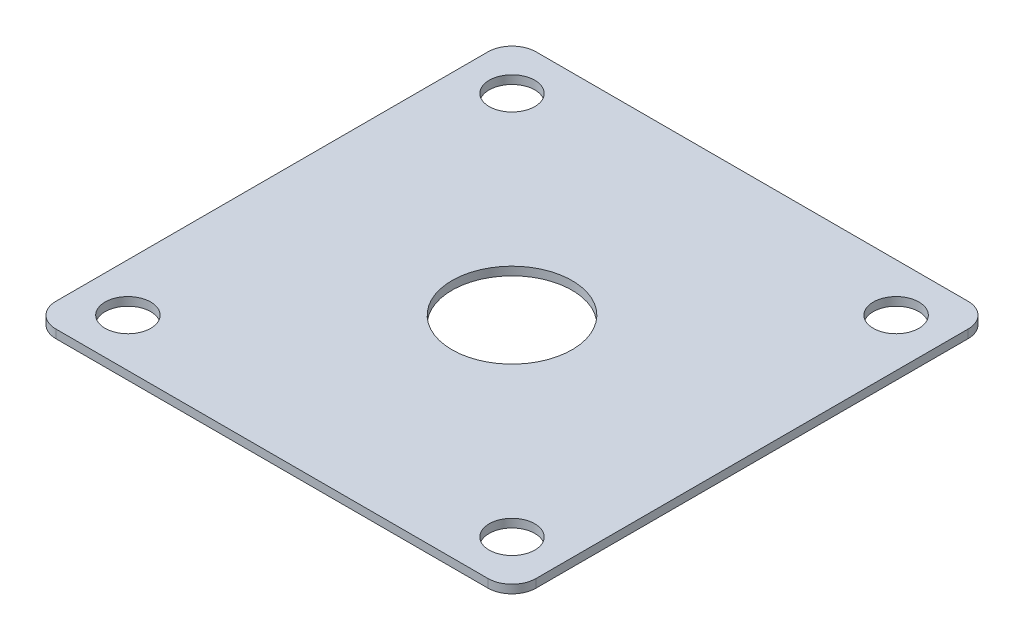
ISO-10303-21;
HEADER;
FILE_DESCRIPTION(('STEP AP214'),'2;1');
FILE_NAME('part.step','',(''),(''),'','','');
FILE_SCHEMA(('AUTOMOTIVE_DESIGN { 1 0 10303 214 1 1 1 1 }'));
ENDSEC;
DATA;
#1=APPLICATION_CONTEXT('core data for automotive mechanical design processes');
#2=APPLICATION_PROTOCOL_DEFINITION('international standard','automotive_design',2000,#1);
#3=PRODUCT_CONTEXT('',#1,'mechanical');
#4=PRODUCT('Part','Part','',(#3));
#5=PRODUCT_RELATED_PRODUCT_CATEGORY('part','',(#4));
#6=PRODUCT_DEFINITION_FORMATION('','',#4);
#7=PRODUCT_DEFINITION_CONTEXT('part definition',#1,'design');
#8=PRODUCT_DEFINITION('design','',#6,#7);
#9=PRODUCT_DEFINITION_SHAPE('','',#8);
#10=(LENGTH_UNIT() NAMED_UNIT(*) SI_UNIT(.MILLI.,.METRE.));
#11=(NAMED_UNIT(*) PLANE_ANGLE_UNIT() SI_UNIT($,.RADIAN.));
#12=(NAMED_UNIT(*) SI_UNIT($,.STERADIAN.) SOLID_ANGLE_UNIT());
#13=UNCERTAINTY_MEASURE_WITH_UNIT(LENGTH_MEASURE(1.E-05),#10,'distance_accuracy_value','');
#14=(GEOMETRIC_REPRESENTATION_CONTEXT(3) GLOBAL_UNCERTAINTY_ASSIGNED_CONTEXT((#13)) GLOBAL_UNIT_ASSIGNED_CONTEXT((#10,
#11,#12)) REPRESENTATION_CONTEXT('',''));
#15=CARTESIAN_POINT('',(0.,0.,0.));
#16=DIRECTION('',(0.,0.,1.));
#17=DIRECTION('',(1.,0.,0.));
#18=AXIS2_PLACEMENT_3D('',#15,#16,#17);
#19=CARTESIAN_POINT('',(0.,0.889,0.));
#20=DIRECTION('',(0.,1.,0.));
#21=DIRECTION('',(0.,0.,1.));
#22=AXIS2_PLACEMENT_3D('',#19,#20,#21);
#23=PLANE('',#22);
#24=CARTESIAN_POINT('',(20.32,0.889,20.32));
#25=DIRECTION('',(0.,1.,0.));
#26=DIRECTION('',(0.,0.,1.));
#27=AXIS2_PLACEMENT_3D('',#24,#25,#26);
#28=CIRCLE('',#27,2.413);
#29=CARTESIAN_POINT('',(20.32,0.889,22.733));
#30=VERTEX_POINT('',#29);
#31=EDGE_CURVE('E215',#30,#30,#28,.T.);
#32=ORIENTED_EDGE('',*,*,#31,.F.);
#33=EDGE_LOOP('',(#32));
#34=FACE_BOUND('',#33,.T.);
#35=CARTESIAN_POINT('',(-20.32,0.889,-20.32));
#36=DIRECTION('',(0.,1.,0.));
#37=DIRECTION('',(0.,0.,1.));
#38=AXIS2_PLACEMENT_3D('',#35,#36,#37);
#39=CIRCLE('',#38,2.413);
#40=CARTESIAN_POINT('',(-20.32,0.889,-17.907));
#41=VERTEX_POINT('',#40);
#42=EDGE_CURVE('E199',#41,#41,#39,.T.);
#43=ORIENTED_EDGE('',*,*,#42,.F.);
#44=EDGE_LOOP('',(#43));
#45=FACE_BOUND('',#44,.T.);
#46=DIRECTION('',(0.,0.,1.));
#47=VECTOR('',#46,1.);
#48=CARTESIAN_POINT('',(-25.4,0.889,-25.4));
#49=LINE('',#48,#47);
#50=CARTESIAN_POINT('',(-25.4,0.889,-22.86));
#51=VERTEX_POINT('',#50);
#52=CARTESIAN_POINT('',(-25.4,0.889,22.86));
#53=VERTEX_POINT('',#52);
#54=EDGE_CURVE('E150',#51,#53,#49,.T.);
#55=ORIENTED_EDGE('',*,*,#54,.T.);
#56=CARTESIAN_POINT('',(-22.86,0.889,22.86));
#57=DIRECTION('',(0.,1.,0.));
#58=DIRECTION('',(0.,0.,1.));
#59=AXIS2_PLACEMENT_3D('',#56,#57,#58);
#60=CIRCLE('',#59,2.54);
#61=CARTESIAN_POINT('',(-22.86,0.889,25.4));
#62=VERTEX_POINT('',#61);
#63=EDGE_CURVE('E174',#53,#62,#60,.T.);
#64=ORIENTED_EDGE('',*,*,#63,.T.);
#65=DIRECTION('',(1.,0.,0.));
#66=VECTOR('',#65,1.);
#67=CARTESIAN_POINT('',(-25.4,0.889,25.4));
#68=LINE('',#67,#66);
#69=CARTESIAN_POINT('',(22.86,0.889,25.4));
#70=VERTEX_POINT('',#69);
#71=EDGE_CURVE('E127',#62,#70,#68,.T.);
#72=ORIENTED_EDGE('',*,*,#71,.T.);
#73=CARTESIAN_POINT('',(22.86,0.889,22.86));
#74=DIRECTION('',(0.,1.,0.));
#75=DIRECTION('',(0.,0.,1.));
#76=AXIS2_PLACEMENT_3D('',#73,#74,#75);
#77=CIRCLE('',#76,2.54);
#78=CARTESIAN_POINT('',(25.4,0.889,22.86));
#79=VERTEX_POINT('',#78);
#80=EDGE_CURVE('E171',#70,#79,#77,.T.);
#81=ORIENTED_EDGE('',*,*,#80,.T.);
#82=DIRECTION('',(0.,0.,-1.));
#83=VECTOR('',#82,1.);
#84=CARTESIAN_POINT('',(25.4,0.889,-25.4));
#85=LINE('',#84,#83);
#86=CARTESIAN_POINT('',(25.4,0.889,-22.86));
#87=VERTEX_POINT('',#86);
#88=EDGE_CURVE('E186',#79,#87,#85,.T.);
#89=ORIENTED_EDGE('',*,*,#88,.T.);
#90=CARTESIAN_POINT('',(22.86,0.889,-22.86));
#91=DIRECTION('',(0.,1.,0.));
#92=DIRECTION('',(0.,0.,1.));
#93=AXIS2_PLACEMENT_3D('',#90,#91,#92);
#94=CIRCLE('',#93,2.54);
#95=CARTESIAN_POINT('',(22.86,0.889,-25.4));
#96=VERTEX_POINT('',#95);
#97=EDGE_CURVE('E61',#87,#96,#94,.T.);
#98=ORIENTED_EDGE('',*,*,#97,.T.);
#99=DIRECTION('',(-1.,0.,0.));
#100=VECTOR('',#99,1.);
#101=CARTESIAN_POINT('',(-25.4,0.889,-25.4));
#102=LINE('',#101,#100);
#103=CARTESIAN_POINT('',(-22.86,0.889,-25.4));
#104=VERTEX_POINT('',#103);
#105=EDGE_CURVE('E152',#96,#104,#102,.T.);
#106=ORIENTED_EDGE('',*,*,#105,.T.);
#107=CARTESIAN_POINT('',(-22.86,0.889,-22.86));
#108=DIRECTION('',(0.,1.,0.));
#109=DIRECTION('',(0.,0.,1.));
#110=AXIS2_PLACEMENT_3D('',#107,#108,#109);
#111=CIRCLE('',#110,2.54);
#112=EDGE_CURVE('E166',#104,#51,#111,.T.);
#113=ORIENTED_EDGE('',*,*,#112,.T.);
#114=EDGE_LOOP('',(#55,#64,#72,#81,#89,#98,#106,#113));
#115=FACE_BOUND('',#114,.T.);
#116=CARTESIAN_POINT('',(0.,0.889,0.));
#117=DIRECTION('',(0.,1.,0.));
#118=DIRECTION('',(0.,0.,1.));
#119=AXIS2_PLACEMENT_3D('',#116,#117,#118);
#120=CIRCLE('',#119,6.35);
#121=CARTESIAN_POINT('',(0.,0.889,6.35));
#122=VERTEX_POINT('',#121);
#123=EDGE_CURVE('E144',#122,#122,#120,.T.);
#124=ORIENTED_EDGE('',*,*,#123,.F.);
#125=EDGE_LOOP('',(#124));
#126=FACE_BOUND('',#125,.T.);
#127=CARTESIAN_POINT('',(-20.32,0.889,20.32));
#128=DIRECTION('',(0.,1.,0.));
#129=DIRECTION('',(0.,0.,-1.));
#130=AXIS2_PLACEMENT_3D('',#127,#128,#129);
#131=CIRCLE('',#130,2.413);
#132=CARTESIAN_POINT('',(-20.32,0.889,17.907));
#133=VERTEX_POINT('',#132);
#134=EDGE_CURVE('E207',#133,#133,#131,.T.);
#135=ORIENTED_EDGE('',*,*,#134,.F.);
#136=EDGE_LOOP('',(#135));
#137=FACE_BOUND('',#136,.T.);
#138=CARTESIAN_POINT('',(20.32,0.889,-20.32));
#139=DIRECTION('',(0.,1.,0.));
#140=DIRECTION('',(0.,0.,-1.));
#141=AXIS2_PLACEMENT_3D('',#138,#139,#140);
#142=CIRCLE('',#141,2.413);
#143=CARTESIAN_POINT('',(20.32,0.889,-22.733));
#144=VERTEX_POINT('',#143);
#145=EDGE_CURVE('E223',#144,#144,#142,.T.);
#146=ORIENTED_EDGE('',*,*,#145,.F.);
#147=EDGE_LOOP('',(#146));
#148=FACE_BOUND('',#147,.T.);
#149=ADVANCED_FACE('F39',(#34,#45,#115,#126,#137,#148),#23,.T.);
#150=CARTESIAN_POINT('',(0.,0.,0.));
#151=DIRECTION('',(0.,1.,0.));
#152=DIRECTION('',(0.,0.,1.));
#153=AXIS2_PLACEMENT_3D('',#150,#151,#152);
#154=PLANE('',#153);
#155=DIRECTION('',(1.,0.,0.));
#156=VECTOR('',#155,1.);
#157=CARTESIAN_POINT('',(-25.4,0.,25.4));
#158=LINE('',#157,#156);
#159=CARTESIAN_POINT('',(-22.86,0.,25.4));
#160=VERTEX_POINT('',#159);
#161=CARTESIAN_POINT('',(22.86,0.,25.4));
#162=VERTEX_POINT('',#161);
#163=EDGE_CURVE('E124',#160,#162,#158,.T.);
#164=ORIENTED_EDGE('',*,*,#163,.F.);
#165=CARTESIAN_POINT('',(-22.86,0.,22.86));
#166=DIRECTION('',(0.,1.,0.));
#167=DIRECTION('',(0.,0.,1.));
#168=AXIS2_PLACEMENT_3D('',#165,#166,#167);
#169=CIRCLE('',#168,2.54);
#170=CARTESIAN_POINT('',(-25.4,0.,22.86));
#171=VERTEX_POINT('',#170);
#172=EDGE_CURVE('E106',#160,#171,#169,.F.);
#173=ORIENTED_EDGE('',*,*,#172,.T.);
#174=DIRECTION('',(0.,0.,1.));
#175=VECTOR('',#174,1.);
#176=CARTESIAN_POINT('',(-25.4,0.,-25.4));
#177=LINE('',#176,#175);
#178=CARTESIAN_POINT('',(-25.4,0.,-22.86));
#179=VERTEX_POINT('',#178);
#180=EDGE_CURVE('E137',#179,#171,#177,.T.);
#181=ORIENTED_EDGE('',*,*,#180,.F.);
#182=CARTESIAN_POINT('',(-22.86,0.,-22.86));
#183=DIRECTION('',(0.,1.,0.));
#184=DIRECTION('',(0.,0.,1.));
#185=AXIS2_PLACEMENT_3D('',#182,#183,#184);
#186=CIRCLE('',#185,2.54);
#187=CARTESIAN_POINT('',(-22.86,0.,-25.4));
#188=VERTEX_POINT('',#187);
#189=EDGE_CURVE('E129',#179,#188,#186,.F.);
#190=ORIENTED_EDGE('',*,*,#189,.T.);
#191=DIRECTION('',(-1.,0.,0.));
#192=VECTOR('',#191,1.);
#193=CARTESIAN_POINT('',(-25.4,0.,-25.4));
#194=LINE('',#193,#192);
#195=CARTESIAN_POINT('',(22.86,0.,-25.4));
#196=VERTEX_POINT('',#195);
#197=EDGE_CURVE('E142',#196,#188,#194,.T.);
#198=ORIENTED_EDGE('',*,*,#197,.F.);
#199=CARTESIAN_POINT('',(22.86,0.,-22.86));
#200=DIRECTION('',(0.,1.,0.));
#201=DIRECTION('',(0.,0.,1.));
#202=AXIS2_PLACEMENT_3D('',#199,#200,#201);
#203=CIRCLE('',#202,2.54);
#204=CARTESIAN_POINT('',(25.4,0.,-22.86));
#205=VERTEX_POINT('',#204);
#206=EDGE_CURVE('E156',#196,#205,#203,.F.);
#207=ORIENTED_EDGE('',*,*,#206,.T.);
#208=DIRECTION('',(0.,0.,-1.));
#209=VECTOR('',#208,1.);
#210=CARTESIAN_POINT('',(25.4,0.,-25.4));
#211=LINE('',#210,#209);
#212=CARTESIAN_POINT('',(25.4,0.,22.86));
#213=VERTEX_POINT('',#212);
#214=EDGE_CURVE('E136',#213,#205,#211,.T.);
#215=ORIENTED_EDGE('',*,*,#214,.F.);
#216=CARTESIAN_POINT('',(22.86,0.,22.86));
#217=DIRECTION('',(0.,1.,0.));
#218=DIRECTION('',(0.,0.,1.));
#219=AXIS2_PLACEMENT_3D('',#216,#217,#218);
#220=CIRCLE('',#219,2.54);
#221=EDGE_CURVE('E118',#213,#162,#220,.F.);
#222=ORIENTED_EDGE('',*,*,#221,.T.);
#223=EDGE_LOOP('',(#164,#173,#181,#190,#198,#207,#215,#222));
#224=FACE_BOUND('',#223,.T.);
#225=CARTESIAN_POINT('',(0.,0.,0.));
#226=DIRECTION('',(0.,1.,0.));
#227=DIRECTION('',(0.,0.,1.));
#228=AXIS2_PLACEMENT_3D('',#225,#226,#227);
#229=CIRCLE('',#228,6.35);
#230=CARTESIAN_POINT('',(0.,0.,6.35));
#231=VERTEX_POINT('',#230);
#232=EDGE_CURVE('E195',#231,#231,#229,.T.);
#233=ORIENTED_EDGE('',*,*,#232,.T.);
#234=EDGE_LOOP('',(#233));
#235=FACE_BOUND('',#234,.T.);
#236=CARTESIAN_POINT('',(-20.32,0.,-20.32));
#237=DIRECTION('',(0.,1.,0.));
#238=DIRECTION('',(0.,0.,1.));
#239=AXIS2_PLACEMENT_3D('',#236,#237,#238);
#240=CIRCLE('',#239,2.413);
#241=CARTESIAN_POINT('',(-20.32,0.,-17.907));
#242=VERTEX_POINT('',#241);
#243=EDGE_CURVE('E203',#242,#242,#240,.T.);
#244=ORIENTED_EDGE('',*,*,#243,.T.);
#245=EDGE_LOOP('',(#244));
#246=FACE_BOUND('',#245,.T.);
#247=CARTESIAN_POINT('',(-20.32,0.,20.32));
#248=DIRECTION('',(0.,1.,0.));
#249=DIRECTION('',(0.,0.,-1.));
#250=AXIS2_PLACEMENT_3D('',#247,#248,#249);
#251=CIRCLE('',#250,2.413);
#252=CARTESIAN_POINT('',(-20.32,0.,17.907));
#253=VERTEX_POINT('',#252);
#254=EDGE_CURVE('E211',#253,#253,#251,.T.);
#255=ORIENTED_EDGE('',*,*,#254,.T.);
#256=EDGE_LOOP('',(#255));
#257=FACE_BOUND('',#256,.T.);
#258=CARTESIAN_POINT('',(20.32,0.,20.32));
#259=DIRECTION('',(0.,1.,0.));
#260=DIRECTION('',(0.,0.,1.));
#261=AXIS2_PLACEMENT_3D('',#258,#259,#260);
#262=CIRCLE('',#261,2.413);
#263=CARTESIAN_POINT('',(20.32,0.,22.733));
#264=VERTEX_POINT('',#263);
#265=EDGE_CURVE('E219',#264,#264,#262,.T.);
#266=ORIENTED_EDGE('',*,*,#265,.T.);
#267=EDGE_LOOP('',(#266));
#268=FACE_BOUND('',#267,.T.);
#269=CARTESIAN_POINT('',(20.32,0.,-20.32));
#270=DIRECTION('',(0.,1.,0.));
#271=DIRECTION('',(0.,0.,-1.));
#272=AXIS2_PLACEMENT_3D('',#269,#270,#271);
#273=CIRCLE('',#272,2.413);
#274=CARTESIAN_POINT('',(20.32,0.,-22.733));
#275=VERTEX_POINT('',#274);
#276=EDGE_CURVE('E227',#275,#275,#273,.T.);
#277=ORIENTED_EDGE('',*,*,#276,.T.);
#278=EDGE_LOOP('',(#277));
#279=FACE_BOUND('',#278,.T.);
#280=ADVANCED_FACE('F132',(#224,#235,#246,#257,#268,#279),#154,.F.);
#281=CARTESIAN_POINT('',(-25.4,0.889,-25.4));
#282=DIRECTION('',(1.,0.,0.));
#283=DIRECTION('',(0.,0.,-1.));
#284=AXIS2_PLACEMENT_3D('',#281,#282,#283);
#285=PLANE('',#284);
#286=ORIENTED_EDGE('',*,*,#180,.T.);
#287=DIRECTION('',(0.,-1.,0.));
#288=VECTOR('',#287,1.);
#289=CARTESIAN_POINT('',(-25.4,0.889,22.86));
#290=LINE('',#289,#288);
#291=EDGE_CURVE('E111',#171,#53,#290,.F.);
#292=ORIENTED_EDGE('',*,*,#291,.T.);
#293=ORIENTED_EDGE('',*,*,#54,.F.);
#294=DIRECTION('',(0.,-1.,0.));
#295=VECTOR('',#294,1.);
#296=CARTESIAN_POINT('',(-25.4,0.889,-22.86));
#297=LINE('',#296,#295);
#298=EDGE_CURVE('E117',#51,#179,#297,.T.);
#299=ORIENTED_EDGE('',*,*,#298,.T.);
#300=EDGE_LOOP('',(#286,#292,#293,#299));
#301=FACE_BOUND('',#300,.T.);
#302=ADVANCED_FACE('F244',(#301),#285,.F.);
#303=CARTESIAN_POINT('',(-25.4,0.889,25.4));
#304=DIRECTION('',(0.,0.,-1.));
#305=DIRECTION('',(-1.,0.,0.));
#306=AXIS2_PLACEMENT_3D('',#303,#304,#305);
#307=PLANE('',#306);
#308=ORIENTED_EDGE('',*,*,#71,.F.);
#309=DIRECTION('',(0.,-1.,0.));
#310=VECTOR('',#309,1.);
#311=CARTESIAN_POINT('',(-22.86,0.889,25.4));
#312=LINE('',#311,#310);
#313=EDGE_CURVE('E110',#62,#160,#312,.T.);
#314=ORIENTED_EDGE('',*,*,#313,.T.);
#315=ORIENTED_EDGE('',*,*,#163,.T.);
#316=DIRECTION('',(0.,-1.,0.));
#317=VECTOR('',#316,1.);
#318=CARTESIAN_POINT('',(22.86,0.889,25.4));
#319=LINE('',#318,#317);
#320=EDGE_CURVE('E130',#162,#70,#319,.F.);
#321=ORIENTED_EDGE('',*,*,#320,.T.);
#322=EDGE_LOOP('',(#308,#314,#315,#321));
#323=FACE_BOUND('',#322,.T.);
#324=ADVANCED_FACE('F123',(#323),#307,.F.);
#325=CARTESIAN_POINT('',(25.4,0.889,-25.4));
#326=DIRECTION('',(-1.,0.,0.));
#327=DIRECTION('',(0.,0.,1.));
#328=AXIS2_PLACEMENT_3D('',#325,#326,#327);
#329=PLANE('',#328);
#330=ORIENTED_EDGE('',*,*,#88,.F.);
#331=DIRECTION('',(0.,-1.,0.));
#332=VECTOR('',#331,1.);
#333=CARTESIAN_POINT('',(25.4,0.889,22.86));
#334=LINE('',#333,#332);
#335=EDGE_CURVE('E180',#79,#213,#334,.T.);
#336=ORIENTED_EDGE('',*,*,#335,.T.);
#337=ORIENTED_EDGE('',*,*,#214,.T.);
#338=DIRECTION('',(0.,-1.,0.));
#339=VECTOR('',#338,1.);
#340=CARTESIAN_POINT('',(25.4,0.889,-22.86));
#341=LINE('',#340,#339);
#342=EDGE_CURVE('E177',#205,#87,#341,.F.);
#343=ORIENTED_EDGE('',*,*,#342,.T.);
#344=EDGE_LOOP('',(#330,#336,#337,#343));
#345=FACE_BOUND('',#344,.T.);
#346=ADVANCED_FACE('F255',(#345),#329,.F.);
#347=CARTESIAN_POINT('',(-25.4,0.889,-25.4));
#348=DIRECTION('',(0.,0.,1.));
#349=DIRECTION('',(1.,0.,0.));
#350=AXIS2_PLACEMENT_3D('',#347,#348,#349);
#351=PLANE('',#350);
#352=ORIENTED_EDGE('',*,*,#105,.F.);
#353=DIRECTION('',(0.,-1.,0.));
#354=VECTOR('',#353,1.);
#355=CARTESIAN_POINT('',(22.86,0.889,-25.4));
#356=LINE('',#355,#354);
#357=EDGE_CURVE('E11',#96,#196,#356,.T.);
#358=ORIENTED_EDGE('',*,*,#357,.T.);
#359=ORIENTED_EDGE('',*,*,#197,.T.);
#360=DIRECTION('',(0.,-1.,0.));
#361=VECTOR('',#360,1.);
#362=CARTESIAN_POINT('',(-22.86,0.889,-25.4));
#363=LINE('',#362,#361);
#364=EDGE_CURVE('E48',#188,#104,#363,.F.);
#365=ORIENTED_EDGE('',*,*,#364,.T.);
#366=EDGE_LOOP('',(#352,#358,#359,#365));
#367=FACE_BOUND('',#366,.T.);
#368=ADVANCED_FACE('F252',(#367),#351,.F.);
#369=CARTESIAN_POINT('',(0.,0.889,0.));
#370=DIRECTION('',(0.,-1.,0.));
#371=DIRECTION('',(0.,0.,-1.));
#372=AXIS2_PLACEMENT_3D('',#369,#370,#371);
#373=CYLINDRICAL_SURFACE('',#372,6.35);
#374=ORIENTED_EDGE('',*,*,#123,.T.);
#375=EDGE_LOOP('',(#374));
#376=FACE_BOUND('',#375,.T.);
#377=ORIENTED_EDGE('',*,*,#232,.F.);
#378=EDGE_LOOP('',(#377));
#379=FACE_BOUND('',#378,.T.);
#380=ADVANCED_FACE('F249',(#376,#379),#373,.F.);
#381=CARTESIAN_POINT('',(-20.32,0.889,-20.32));
#382=DIRECTION('',(0.,-1.,0.));
#383=DIRECTION('',(0.,0.,-1.));
#384=AXIS2_PLACEMENT_3D('',#381,#382,#383);
#385=CYLINDRICAL_SURFACE('',#384,2.413);
#386=ORIENTED_EDGE('',*,*,#42,.T.);
#387=EDGE_LOOP('',(#386));
#388=FACE_BOUND('',#387,.T.);
#389=ORIENTED_EDGE('',*,*,#243,.F.);
#390=EDGE_LOOP('',(#389));
#391=FACE_BOUND('',#390,.T.);
#392=ADVANCED_FACE('F290',(#388,#391),#385,.F.);
#393=CARTESIAN_POINT('',(-20.32,0.889,20.32));
#394=DIRECTION('',(0.,-1.,0.));
#395=DIRECTION('',(0.,0.,-1.));
#396=AXIS2_PLACEMENT_3D('',#393,#394,#395);
#397=CYLINDRICAL_SURFACE('',#396,2.413);
#398=ORIENTED_EDGE('',*,*,#134,.T.);
#399=EDGE_LOOP('',(#398));
#400=FACE_BOUND('',#399,.T.);
#401=ORIENTED_EDGE('',*,*,#254,.F.);
#402=EDGE_LOOP('',(#401));
#403=FACE_BOUND('',#402,.T.);
#404=ADVANCED_FACE('F286',(#400,#403),#397,.F.);
#405=CARTESIAN_POINT('',(20.32,0.889,20.32));
#406=DIRECTION('',(0.,-1.,0.));
#407=DIRECTION('',(0.,0.,-1.));
#408=AXIS2_PLACEMENT_3D('',#405,#406,#407);
#409=CYLINDRICAL_SURFACE('',#408,2.413);
#410=ORIENTED_EDGE('',*,*,#31,.T.);
#411=EDGE_LOOP('',(#410));
#412=FACE_BOUND('',#411,.T.);
#413=ORIENTED_EDGE('',*,*,#265,.F.);
#414=EDGE_LOOP('',(#413));
#415=FACE_BOUND('',#414,.T.);
#416=ADVANCED_FACE('F289',(#412,#415),#409,.F.);
#417=CARTESIAN_POINT('',(20.32,0.889,-20.32));
#418=DIRECTION('',(0.,-1.,0.));
#419=DIRECTION('',(0.,0.,-1.));
#420=AXIS2_PLACEMENT_3D('',#417,#418,#419);
#421=CYLINDRICAL_SURFACE('',#420,2.413);
#422=ORIENTED_EDGE('',*,*,#145,.T.);
#423=EDGE_LOOP('',(#422));
#424=FACE_BOUND('',#423,.T.);
#425=ORIENTED_EDGE('',*,*,#276,.F.);
#426=EDGE_LOOP('',(#425));
#427=FACE_BOUND('',#426,.T.);
#428=ADVANCED_FACE('F235',(#424,#427),#421,.F.);
#429=CARTESIAN_POINT('',(-22.86,0.889,22.86));
#430=DIRECTION('',(0.,-1.,0.));
#431=DIRECTION('',(0.,0.,-1.));
#432=AXIS2_PLACEMENT_3D('',#429,#430,#431);
#433=CYLINDRICAL_SURFACE('',#432,2.54);
#434=ORIENTED_EDGE('',*,*,#63,.F.);
#435=ORIENTED_EDGE('',*,*,#291,.F.);
#436=ORIENTED_EDGE('',*,*,#172,.F.);
#437=ORIENTED_EDGE('',*,*,#313,.F.);
#438=EDGE_LOOP('',(#434,#435,#436,#437));
#439=FACE_BOUND('',#438,.T.);
#440=ADVANCED_FACE('F109',(#439),#433,.T.);
#441=CARTESIAN_POINT('',(22.86,0.889,22.86));
#442=DIRECTION('',(0.,-1.,0.));
#443=DIRECTION('',(0.,0.,-1.));
#444=AXIS2_PLACEMENT_3D('',#441,#442,#443);
#445=CYLINDRICAL_SURFACE('',#444,2.54);
#446=ORIENTED_EDGE('',*,*,#80,.F.);
#447=ORIENTED_EDGE('',*,*,#320,.F.);
#448=ORIENTED_EDGE('',*,*,#221,.F.);
#449=ORIENTED_EDGE('',*,*,#335,.F.);
#450=EDGE_LOOP('',(#446,#447,#448,#449));
#451=FACE_BOUND('',#450,.T.);
#452=ADVANCED_FACE('F266',(#451),#445,.T.);
#453=CARTESIAN_POINT('',(22.86,0.889,-22.86));
#454=DIRECTION('',(0.,-1.,0.));
#455=DIRECTION('',(0.,0.,-1.));
#456=AXIS2_PLACEMENT_3D('',#453,#454,#455);
#457=CYLINDRICAL_SURFACE('',#456,2.54);
#458=ORIENTED_EDGE('',*,*,#97,.F.);
#459=ORIENTED_EDGE('',*,*,#342,.F.);
#460=ORIENTED_EDGE('',*,*,#206,.F.);
#461=ORIENTED_EDGE('',*,*,#357,.F.);
#462=EDGE_LOOP('',(#458,#459,#460,#461));
#463=FACE_BOUND('',#462,.T.);
#464=ADVANCED_FACE('F268',(#463),#457,.T.);
#465=CARTESIAN_POINT('',(-22.86,0.889,-22.86));
#466=DIRECTION('',(0.,-1.,0.));
#467=DIRECTION('',(0.,0.,-1.));
#468=AXIS2_PLACEMENT_3D('',#465,#466,#467);
#469=CYLINDRICAL_SURFACE('',#468,2.54);
#470=ORIENTED_EDGE('',*,*,#112,.F.);
#471=ORIENTED_EDGE('',*,*,#364,.F.);
#472=ORIENTED_EDGE('',*,*,#189,.F.);
#473=ORIENTED_EDGE('',*,*,#298,.F.);
#474=EDGE_LOOP('',(#470,#471,#472,#473));
#475=FACE_BOUND('',#474,.T.);
#476=ADVANCED_FACE('F41',(#475),#469,.T.);
#477=CLOSED_SHELL('',(#149,#280,#302,#324,#346,#368,#380,#392,#404,#416,#428,#440,#452,#464,#476));
#478=MANIFOLD_SOLID_BREP('B2',#477);
#479=ADVANCED_BREP_SHAPE_REPRESENTATION('',(#18,#478),#14);
#480=SHAPE_DEFINITION_REPRESENTATION(#9,#479);
ENDSEC;
END-ISO-10303-21;
